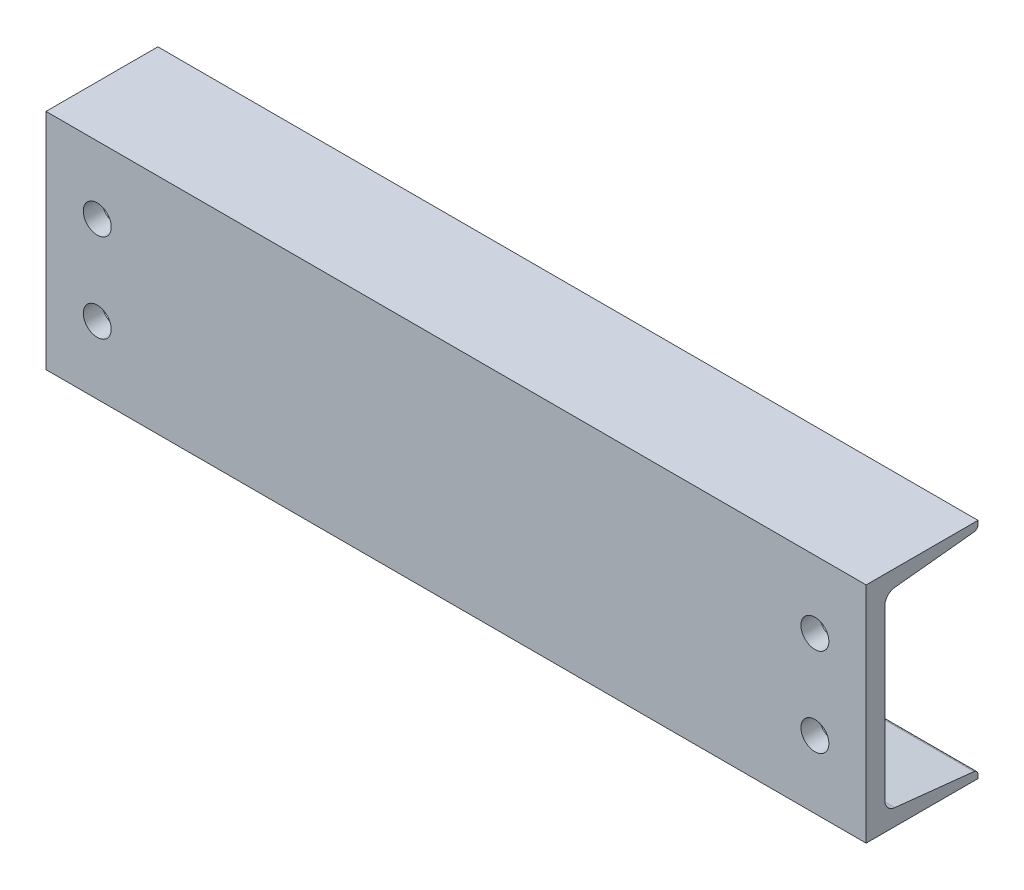
ISO-10303-21;
HEADER;
FILE_DESCRIPTION(('STEP AP214'),'2;1');
FILE_NAME('part.step','',(''),(''),'','','');
FILE_SCHEMA(('AUTOMOTIVE_DESIGN { 1 0 10303 214 1 1 1 1 }'));
ENDSEC;
DATA;
#1=APPLICATION_CONTEXT('core data for automotive mechanical design processes');
#2=APPLICATION_PROTOCOL_DEFINITION('international standard','automotive_design',2000,#1);
#3=PRODUCT_CONTEXT('',#1,'mechanical');
#4=PRODUCT('Part','Part','',(#3));
#5=PRODUCT_RELATED_PRODUCT_CATEGORY('part','',(#4));
#6=PRODUCT_DEFINITION_FORMATION('','',#4);
#7=PRODUCT_DEFINITION_CONTEXT('part definition',#1,'design');
#8=PRODUCT_DEFINITION('design','',#6,#7);
#9=PRODUCT_DEFINITION_SHAPE('','',#8);
#10=(LENGTH_UNIT() NAMED_UNIT(*) SI_UNIT(.MILLI.,.METRE.));
#11=(NAMED_UNIT(*) PLANE_ANGLE_UNIT() SI_UNIT($,.RADIAN.));
#12=(NAMED_UNIT(*) SI_UNIT($,.STERADIAN.) SOLID_ANGLE_UNIT());
#13=UNCERTAINTY_MEASURE_WITH_UNIT(LENGTH_MEASURE(1.E-05),#10,'distance_accuracy_value','');
#14=(GEOMETRIC_REPRESENTATION_CONTEXT(3) GLOBAL_UNCERTAINTY_ASSIGNED_CONTEXT((#13)) GLOBAL_UNIT_ASSIGNED_CONTEXT((#10,
#11,#12)) REPRESENTATION_CONTEXT('',''));
#15=CARTESIAN_POINT('',(0.,0.,0.));
#16=DIRECTION('',(0.,0.,1.));
#17=DIRECTION('',(1.,0.,0.));
#18=AXIS2_PLACEMENT_3D('',#15,#16,#17);
#19=CARTESIAN_POINT('',(279.4,-76.2,48.8061));
#20=DIRECTION('',(0.,1.,0.));
#21=DIRECTION('',(0.,0.,1.));
#22=AXIS2_PLACEMENT_3D('',#19,#20,#21);
#23=PLANE('',#22);
#24=CARTESIAN_POINT('',(165.1,-76.2,10.7061000000001));
#25=DIRECTION('',(0.,-1.,0.));
#26=DIRECTION('',(0.,0.,1.));
#27=AXIS2_PLACEMENT_3D('',#24,#25,#26);
#28=CIRCLE('',#27,9.525);
#29=CARTESIAN_POINT('',(165.1,-76.2,20.2311));
#30=VERTEX_POINT('',#29);
#31=EDGE_CURVE('E267',#30,#30,#28,.T.);
#32=ORIENTED_EDGE('',*,*,#31,.F.);
#33=EDGE_LOOP('',(#32));
#34=FACE_BOUND('',#33,.T.);
#35=CARTESIAN_POINT('',(-165.1,-76.2,10.7061));
#36=DIRECTION('',(0.,-1.,0.));
#37=DIRECTION('',(0.,0.,-1.));
#38=AXIS2_PLACEMENT_3D('',#35,#36,#37);
#39=CIRCLE('',#38,9.525);
#40=CARTESIAN_POINT('',(-165.1,-76.2,1.18110000000001));
#41=VERTEX_POINT('',#40);
#42=EDGE_CURVE('E270',#41,#41,#39,.T.);
#43=ORIENTED_EDGE('',*,*,#42,.F.);
#44=EDGE_LOOP('',(#43));
#45=FACE_BOUND('',#44,.T.);
#46=DIRECTION('',(0.,0.,-1.));
#47=VECTOR('',#46,1.);
#48=CARTESIAN_POINT('',(-279.4,-76.2,48.8061));
#49=LINE('',#48,#47);
#50=CARTESIAN_POINT('',(-279.4,-76.2,48.8061));
#51=VERTEX_POINT('',#50);
#52=CARTESIAN_POINT('',(-279.4,-76.2,-27.3939));
#53=VERTEX_POINT('',#52);
#54=EDGE_CURVE('E155',#51,#53,#49,.T.);
#55=ORIENTED_EDGE('',*,*,#54,.T.);
#56=DIRECTION('',(-1.,0.,0.));
#57=VECTOR('',#56,1.);
#58=CARTESIAN_POINT('',(279.4,-76.2,-27.3939));
#59=LINE('',#58,#57);
#60=CARTESIAN_POINT('',(279.4,-76.2,-27.3939));
#61=VERTEX_POINT('',#60);
#62=EDGE_CURVE('E11',#61,#53,#59,.T.);
#63=ORIENTED_EDGE('',*,*,#62,.F.);
#64=DIRECTION('',(0.,0.,-1.));
#65=VECTOR('',#64,1.);
#66=CARTESIAN_POINT('',(279.4,-76.2,48.8061));
#67=LINE('',#66,#65);
#68=CARTESIAN_POINT('',(279.4,-76.2,48.8061));
#69=VERTEX_POINT('',#68);
#70=EDGE_CURVE('E178',#69,#61,#67,.T.);
#71=ORIENTED_EDGE('',*,*,#70,.F.);
#72=DIRECTION('',(-1.,0.,0.));
#73=VECTOR('',#72,1.);
#74=CARTESIAN_POINT('',(279.4,-76.2,48.8061));
#75=LINE('',#74,#73);
#76=EDGE_CURVE('E151',#69,#51,#75,.T.);
#77=ORIENTED_EDGE('',*,*,#76,.T.);
#78=EDGE_LOOP('',(#55,#63,#71,#77));
#79=FACE_BOUND('',#78,.T.);
#80=ADVANCED_FACE('F35',(#34,#45,#79),#23,.F.);
#81=CARTESIAN_POINT('',(279.4,-76.2,-27.3939));
#82=DIRECTION('',(0.,0.,1.));
#83=DIRECTION('',(1.,0.,0.));
#84=AXIS2_PLACEMENT_3D('',#81,#82,#83);
#85=PLANE('',#84);
#86=DIRECTION('',(0.,1.,0.));
#87=VECTOR('',#86,1.);
#88=CARTESIAN_POINT('',(-279.4,-76.2,-27.3939));
#89=LINE('',#88,#87);
#90=CARTESIAN_POINT('',(-279.4,-73.7107446530364,-27.3939));
#91=VERTEX_POINT('',#90);
#92=EDGE_CURVE('E158',#53,#91,#89,.T.);
#93=ORIENTED_EDGE('',*,*,#92,.T.);
#94=DIRECTION('',(-1.,0.,0.));
#95=VECTOR('',#94,1.);
#96=CARTESIAN_POINT('',(279.4,-73.7107446530364,-27.3939));
#97=LINE('',#96,#95);
#98=CARTESIAN_POINT('',(279.4,-73.7107446530364,-27.3939));
#99=VERTEX_POINT('',#98);
#100=EDGE_CURVE('E43',#99,#91,#97,.T.);
#101=ORIENTED_EDGE('',*,*,#100,.F.);
#102=DIRECTION('',(0.,1.,0.));
#103=VECTOR('',#102,1.);
#104=CARTESIAN_POINT('',(279.4,-76.2,-27.3939));
#105=LINE('',#104,#103);
#106=EDGE_CURVE('E106',#61,#99,#105,.T.);
#107=ORIENTED_EDGE('',*,*,#106,.F.);
#108=ORIENTED_EDGE('',*,*,#62,.T.);
#109=EDGE_LOOP('',(#93,#101,#107,#108));
#110=FACE_BOUND('',#109,.T.);
#111=ADVANCED_FACE('F259',(#110),#85,.F.);
#112=CARTESIAN_POINT('',(279.4,-73.7107446530364,-24.3459));
#113=DIRECTION('',(-1.,0.,0.));
#114=DIRECTION('',(0.,0.,1.));
#115=AXIS2_PLACEMENT_3D('',#112,#113,#114);
#116=CYLINDRICAL_SURFACE('',#115,3.04799999999999);
#117=CARTESIAN_POINT('',(-279.4,-73.7107446530364,-24.3459));
#118=DIRECTION('',(1.,0.,0.));
#119=DIRECTION('',(0.,0.,-1.));
#120=AXIS2_PLACEMENT_3D('',#117,#118,#119);
#121=CIRCLE('',#120,3.04799999999999);
#122=CARTESIAN_POINT('',(-279.4,-70.6796721065635,-24.6666853145304));
#123=VERTEX_POINT('',#122);
#124=EDGE_CURVE('E161',#91,#123,#121,.T.);
#125=ORIENTED_EDGE('',*,*,#124,.T.);
#126=DIRECTION('',(-1.,0.,0.));
#127=VECTOR('',#126,1.);
#128=CARTESIAN_POINT('',(279.4,-70.6796721065635,-24.6666853145304));
#129=LINE('',#128,#127);
#130=CARTESIAN_POINT('',(279.4,-70.6796721065635,-24.6666853145304));
#131=VERTEX_POINT('',#130);
#132=EDGE_CURVE('E197',#131,#123,#129,.T.);
#133=ORIENTED_EDGE('',*,*,#132,.F.);
#134=CARTESIAN_POINT('',(279.4,-73.7107446530364,-24.3459));
#135=DIRECTION('',(1.,0.,0.));
#136=DIRECTION('',(0.,0.,-1.));
#137=AXIS2_PLACEMENT_3D('',#134,#135,#136);
#138=CIRCLE('',#137,3.04799999999999);
#139=EDGE_CURVE('E205',#99,#131,#138,.T.);
#140=ORIENTED_EDGE('',*,*,#139,.F.);
#141=ORIENTED_EDGE('',*,*,#100,.T.);
#142=EDGE_LOOP('',(#125,#133,#140,#141));
#143=FACE_BOUND('',#142,.T.);
#144=ADVANCED_FACE('F203',(#143),#116,.T.);
#145=CARTESIAN_POINT('',(279.4,-64.9695181148763,29.288063286326));
#146=DIRECTION('',(0.,-0.994446373514726,0.105244525764574));
#147=DIRECTION('',(0.,-0.105244525764574,-0.994446373514726));
#148=AXIS2_PLACEMENT_3D('',#145,#146,#147);
#149=PLANE('',#148);
#150=CARTESIAN_POINT('',(165.1,-66.9360896323852,10.7061000000001));
#151=DIRECTION('',(0.,-0.994446373514726,0.105244525764574));
#152=DIRECTION('',(0.,-0.105244525764574,-0.994446373514726));
#153=AXIS2_PLACEMENT_3D('',#150,#151,#152);
#154=ELLIPSE('',#153,9.57819371027044,9.525);
#155=CARTESIAN_POINT('',(165.1,-67.9441420871039,1.18110000000005));
#156=VERTEX_POINT('',#155);
#157=EDGE_CURVE('E273',#156,#156,#154,.F.);
#158=ORIENTED_EDGE('',*,*,#157,.F.);
#159=EDGE_LOOP('',(#158));
#160=FACE_BOUND('',#159,.T.);
#161=CARTESIAN_POINT('',(-165.1,-66.9360896323853,10.7061));
#162=DIRECTION('',(0.,-0.994446373514726,0.105244525764574));
#163=DIRECTION('',(0.,-0.105244525764574,-0.994446373514726));
#164=AXIS2_PLACEMENT_3D('',#161,#162,#163);
#165=ELLIPSE('',#164,9.57819371027044,9.525);
#166=CARTESIAN_POINT('',(-165.1,-67.9441420871039,1.18110000000001));
#167=VERTEX_POINT('',#166);
#168=EDGE_CURVE('E272',#167,#167,#165,.F.);
#169=ORIENTED_EDGE('',*,*,#168,.F.);
#170=EDGE_LOOP('',(#169));
#171=FACE_BOUND('',#170,.T.);
#172=DIRECTION('',(0.,0.105244525764574,0.994446373514726));
#173=VECTOR('',#172,1.);
#174=CARTESIAN_POINT('',(-279.4,-64.9695181148763,29.288063286326));
#175=LINE('',#174,#173);
#176=CARTESIAN_POINT('',(-279.4,-64.9695181148763,29.288063286326));
#177=VERTEX_POINT('',#176);
#178=EDGE_CURVE('E163',#123,#177,#175,.T.);
#179=ORIENTED_EDGE('',*,*,#178,.T.);
#180=DIRECTION('',(-1.,0.,0.));
#181=VECTOR('',#180,1.);
#182=CARTESIAN_POINT('',(279.4,-64.9695181148763,29.288063286326));
#183=LINE('',#182,#181);
#184=CARTESIAN_POINT('',(279.4,-64.9695181148763,29.288063286326));
#185=VERTEX_POINT('',#184);
#186=EDGE_CURVE('E194',#185,#177,#183,.T.);
#187=ORIENTED_EDGE('',*,*,#186,.F.);
#188=DIRECTION('',(0.,0.105244525764574,0.994446373514726));
#189=VECTOR('',#188,1.);
#190=CARTESIAN_POINT('',(279.4,-64.9695181148763,29.288063286326));
#191=LINE('',#190,#189);
#192=EDGE_CURVE('E223',#131,#185,#191,.T.);
#193=ORIENTED_EDGE('',*,*,#192,.F.);
#194=ORIENTED_EDGE('',*,*,#132,.T.);
#195=EDGE_LOOP('',(#179,#187,#193,#194));
#196=FACE_BOUND('',#195,.T.);
#197=ADVANCED_FACE('F214',(#160,#171,#196),#149,.F.);
#198=CARTESIAN_POINT('',(279.4,-57.3918367486941,28.4861));
#199=DIRECTION('',(-1.,0.,0.));
#200=DIRECTION('',(0.,0.,1.));
#201=AXIS2_PLACEMENT_3D('',#198,#199,#200);
#202=CYLINDRICAL_SURFACE('',#201,7.62000000000001);
#203=CARTESIAN_POINT('',(-279.4,-57.3918367486941,28.4861));
#204=DIRECTION('',(-1.,0.,0.));
#205=DIRECTION('',(0.,0.,-1.));
#206=AXIS2_PLACEMENT_3D('',#203,#204,#205);
#207=CIRCLE('',#206,7.62000000000001);
#208=CARTESIAN_POINT('',(-279.4,-57.3918367486941,36.1061));
#209=VERTEX_POINT('',#208);
#210=EDGE_CURVE('E165',#177,#209,#207,.T.);
#211=ORIENTED_EDGE('',*,*,#210,.T.);
#212=DIRECTION('',(-1.,0.,0.));
#213=VECTOR('',#212,1.);
#214=CARTESIAN_POINT('',(279.4,-57.3918367486941,36.1061));
#215=LINE('',#214,#213);
#216=CARTESIAN_POINT('',(279.4,-57.3918367486941,36.1061));
#217=VERTEX_POINT('',#216);
#218=EDGE_CURVE('E191',#217,#209,#215,.T.);
#219=ORIENTED_EDGE('',*,*,#218,.F.);
#220=CARTESIAN_POINT('',(279.4,-57.3918367486941,28.4861));
#221=DIRECTION('',(-1.,0.,0.));
#222=DIRECTION('',(0.,0.,-1.));
#223=AXIS2_PLACEMENT_3D('',#220,#221,#222);
#224=CIRCLE('',#223,7.62000000000001);
#225=EDGE_CURVE('E220',#185,#217,#224,.T.);
#226=ORIENTED_EDGE('',*,*,#225,.F.);
#227=ORIENTED_EDGE('',*,*,#186,.T.);
#228=EDGE_LOOP('',(#211,#219,#226,#227));
#229=FACE_BOUND('',#228,.T.);
#230=ADVANCED_FACE('F218',(#229),#202,.F.);
#231=CARTESIAN_POINT('',(279.4,57.3918367486941,36.1061));
#232=DIRECTION('',(0.,0.,1.));
#233=DIRECTION('',(0.,-1.,0.));
#234=AXIS2_PLACEMENT_3D('',#231,#232,#233);
#235=PLANE('',#234);
#236=CARTESIAN_POINT('',(244.475,30.1625,36.1061));
#237=DIRECTION('',(0.,0.,1.));
#238=DIRECTION('',(0.,-1.,0.));
#239=AXIS2_PLACEMENT_3D('',#236,#237,#238);
#240=CIRCLE('',#239,9.52500000000002);
#241=CARTESIAN_POINT('',(244.475,20.6374999999999,36.1061));
#242=VERTEX_POINT('',#241);
#243=EDGE_CURVE('E284',#242,#242,#240,.F.);
#244=ORIENTED_EDGE('',*,*,#243,.F.);
#245=EDGE_LOOP('',(#244));
#246=FACE_BOUND('',#245,.T.);
#247=CARTESIAN_POINT('',(244.475,-30.1625,36.1061));
#248=DIRECTION('',(0.,0.,1.));
#249=DIRECTION('',(0.,-1.,0.));
#250=AXIS2_PLACEMENT_3D('',#247,#248,#249);
#251=CIRCLE('',#250,9.52500000000002);
#252=CARTESIAN_POINT('',(244.475,-39.6875,36.1061));
#253=VERTEX_POINT('',#252);
#254=EDGE_CURVE('E290',#253,#253,#251,.F.);
#255=ORIENTED_EDGE('',*,*,#254,.F.);
#256=EDGE_LOOP('',(#255));
#257=FACE_BOUND('',#256,.T.);
#258=CARTESIAN_POINT('',(-244.475,-30.1625,36.1061));
#259=DIRECTION('',(0.,0.,1.));
#260=DIRECTION('',(0.,-1.,0.));
#261=AXIS2_PLACEMENT_3D('',#258,#259,#260);
#262=CIRCLE('',#261,9.52500000000002);
#263=CARTESIAN_POINT('',(-244.475,-39.6875000000001,36.1061));
#264=VERTEX_POINT('',#263);
#265=EDGE_CURVE('E296',#264,#264,#262,.F.);
#266=ORIENTED_EDGE('',*,*,#265,.F.);
#267=EDGE_LOOP('',(#266));
#268=FACE_BOUND('',#267,.T.);
#269=CARTESIAN_POINT('',(-244.475,30.1625,36.1061));
#270=DIRECTION('',(0.,0.,1.));
#271=DIRECTION('',(0.,-1.,0.));
#272=AXIS2_PLACEMENT_3D('',#269,#270,#271);
#273=CIRCLE('',#272,9.52500000000002);
#274=CARTESIAN_POINT('',(-244.475,20.6375,36.1061));
#275=VERTEX_POINT('',#274);
#276=EDGE_CURVE('E159',#275,#275,#273,.F.);
#277=ORIENTED_EDGE('',*,*,#276,.F.);
#278=EDGE_LOOP('',(#277));
#279=FACE_BOUND('',#278,.T.);
#280=DIRECTION('',(0.,1.,0.));
#281=VECTOR('',#280,1.);
#282=CARTESIAN_POINT('',(-279.4,57.3918367486941,36.1061));
#283=LINE('',#282,#281);
#284=CARTESIAN_POINT('',(-279.4,57.3918367486941,36.1061));
#285=VERTEX_POINT('',#284);
#286=EDGE_CURVE('E167',#209,#285,#283,.T.);
#287=ORIENTED_EDGE('',*,*,#286,.T.);
#288=DIRECTION('',(-1.,0.,0.));
#289=VECTOR('',#288,1.);
#290=CARTESIAN_POINT('',(279.4,57.3918367486941,36.1061));
#291=LINE('',#290,#289);
#292=CARTESIAN_POINT('',(279.4,57.3918367486941,36.1061));
#293=VERTEX_POINT('',#292);
#294=EDGE_CURVE('E188',#293,#285,#291,.T.);
#295=ORIENTED_EDGE('',*,*,#294,.F.);
#296=DIRECTION('',(0.,1.,0.));
#297=VECTOR('',#296,1.);
#298=CARTESIAN_POINT('',(279.4,57.3918367486941,36.1061));
#299=LINE('',#298,#297);
#300=EDGE_CURVE('E222',#217,#293,#299,.T.);
#301=ORIENTED_EDGE('',*,*,#300,.F.);
#302=ORIENTED_EDGE('',*,*,#218,.T.);
#303=EDGE_LOOP('',(#287,#295,#301,#302));
#304=FACE_BOUND('',#303,.T.);
#305=ADVANCED_FACE('F309',(#246,#257,#268,#279,#304),#235,.F.);
#306=CARTESIAN_POINT('',(279.4,57.3918367486941,28.4861));
#307=DIRECTION('',(-1.,0.,0.));
#308=DIRECTION('',(0.,0.,1.));
#309=AXIS2_PLACEMENT_3D('',#306,#307,#308);
#310=CYLINDRICAL_SURFACE('',#309,7.62000000000002);
#311=CARTESIAN_POINT('',(-279.4,57.3918367486941,28.4861));
#312=DIRECTION('',(-1.,0.,0.));
#313=DIRECTION('',(0.,0.,1.));
#314=AXIS2_PLACEMENT_3D('',#311,#312,#313);
#315=CIRCLE('',#314,7.62000000000002);
#316=CARTESIAN_POINT('',(-279.4,64.9695181148764,29.2880632863261));
#317=VERTEX_POINT('',#316);
#318=EDGE_CURVE('E169',#285,#317,#315,.T.);
#319=ORIENTED_EDGE('',*,*,#318,.T.);
#320=DIRECTION('',(-1.,0.,0.));
#321=VECTOR('',#320,1.);
#322=CARTESIAN_POINT('',(279.4,64.9695181148764,29.2880632863261));
#323=LINE('',#322,#321);
#324=CARTESIAN_POINT('',(279.4,64.9695181148764,29.2880632863261));
#325=VERTEX_POINT('',#324);
#326=EDGE_CURVE('E185',#325,#317,#323,.T.);
#327=ORIENTED_EDGE('',*,*,#326,.F.);
#328=CARTESIAN_POINT('',(279.4,57.3918367486941,28.4861));
#329=DIRECTION('',(-1.,0.,0.));
#330=DIRECTION('',(0.,0.,1.));
#331=AXIS2_PLACEMENT_3D('',#328,#329,#330);
#332=CIRCLE('',#331,7.62000000000002);
#333=EDGE_CURVE('E225',#293,#325,#332,.T.);
#334=ORIENTED_EDGE('',*,*,#333,.F.);
#335=ORIENTED_EDGE('',*,*,#294,.T.);
#336=EDGE_LOOP('',(#319,#327,#334,#335));
#337=FACE_BOUND('',#336,.T.);
#338=ADVANCED_FACE('F312',(#337),#310,.F.);
#339=CARTESIAN_POINT('',(279.4,64.9695181148764,29.2880632863261));
#340=DIRECTION('',(0.,0.994446373514726,0.105244525764573));
#341=DIRECTION('',(0.,-0.105244525764573,0.994446373514726));
#342=AXIS2_PLACEMENT_3D('',#339,#340,#341);
#343=PLANE('',#342);
#344=DIRECTION('',(0.,0.105244525764573,-0.994446373514726));
#345=VECTOR('',#344,1.);
#346=CARTESIAN_POINT('',(-279.4,64.9695181148764,29.2880632863261));
#347=LINE('',#346,#345);
#348=CARTESIAN_POINT('',(-279.4,70.6796721065635,-24.6666853145304));
#349=VERTEX_POINT('',#348);
#350=EDGE_CURVE('E171',#317,#349,#347,.T.);
#351=ORIENTED_EDGE('',*,*,#350,.T.);
#352=DIRECTION('',(-1.,0.,0.));
#353=VECTOR('',#352,1.);
#354=CARTESIAN_POINT('',(279.4,70.6796721065635,-24.6666853145304));
#355=LINE('',#354,#353);
#356=CARTESIAN_POINT('',(279.4,70.6796721065635,-24.6666853145304));
#357=VERTEX_POINT('',#356);
#358=EDGE_CURVE('E182',#357,#349,#355,.T.);
#359=ORIENTED_EDGE('',*,*,#358,.F.);
#360=DIRECTION('',(0.,0.105244525764573,-0.994446373514726));
#361=VECTOR('',#360,1.);
#362=CARTESIAN_POINT('',(279.4,64.9695181148764,29.2880632863261));
#363=LINE('',#362,#361);
#364=EDGE_CURVE('E231',#325,#357,#363,.T.);
#365=ORIENTED_EDGE('',*,*,#364,.F.);
#366=ORIENTED_EDGE('',*,*,#326,.T.);
#367=EDGE_LOOP('',(#351,#359,#365,#366));
#368=FACE_BOUND('',#367,.T.);
#369=ADVANCED_FACE('F237',(#368),#343,.F.);
#370=CARTESIAN_POINT('',(279.4,73.7107446530364,-24.3459));
#371=DIRECTION('',(-1.,0.,0.));
#372=DIRECTION('',(0.,0.,1.));
#373=AXIS2_PLACEMENT_3D('',#370,#371,#372);
#374=CYLINDRICAL_SURFACE('',#373,3.048);
#375=CARTESIAN_POINT('',(-279.4,73.7107446530364,-24.3459));
#376=DIRECTION('',(1.,0.,0.));
#377=DIRECTION('',(0.,0.,1.));
#378=AXIS2_PLACEMENT_3D('',#375,#376,#377);
#379=CIRCLE('',#378,3.048);
#380=CARTESIAN_POINT('',(-279.4,73.7107446530364,-27.3939));
#381=VERTEX_POINT('',#380);
#382=EDGE_CURVE('E173',#349,#381,#379,.T.);
#383=ORIENTED_EDGE('',*,*,#382,.T.);
#384=DIRECTION('',(-1.,0.,0.));
#385=VECTOR('',#384,1.);
#386=CARTESIAN_POINT('',(279.4,73.7107446530364,-27.3939));
#387=LINE('',#386,#385);
#388=CARTESIAN_POINT('',(279.4,73.7107446530364,-27.3939));
#389=VERTEX_POINT('',#388);
#390=EDGE_CURVE('E146',#389,#381,#387,.T.);
#391=ORIENTED_EDGE('',*,*,#390,.F.);
#392=CARTESIAN_POINT('',(279.4,73.7107446530364,-24.3459));
#393=DIRECTION('',(1.,0.,0.));
#394=DIRECTION('',(0.,0.,1.));
#395=AXIS2_PLACEMENT_3D('',#392,#393,#394);
#396=CIRCLE('',#395,3.048);
#397=EDGE_CURVE('E137',#357,#389,#396,.T.);
#398=ORIENTED_EDGE('',*,*,#397,.F.);
#399=ORIENTED_EDGE('',*,*,#358,.T.);
#400=EDGE_LOOP('',(#383,#391,#398,#399));
#401=FACE_BOUND('',#400,.T.);
#402=ADVANCED_FACE('F241',(#401),#374,.T.);
#403=CARTESIAN_POINT('',(279.4,76.2,-27.3939));
#404=DIRECTION('',(0.,0.,1.));
#405=DIRECTION('',(0.,-1.,0.));
#406=AXIS2_PLACEMENT_3D('',#403,#404,#405);
#407=PLANE('',#406);
#408=DIRECTION('',(0.,1.,0.));
#409=VECTOR('',#408,1.);
#410=CARTESIAN_POINT('',(-279.4,76.2,-27.3939));
#411=LINE('',#410,#409);
#412=CARTESIAN_POINT('',(-279.4,76.2,-27.3939));
#413=VERTEX_POINT('',#412);
#414=EDGE_CURVE('E145',#381,#413,#411,.T.);
#415=ORIENTED_EDGE('',*,*,#414,.T.);
#416=DIRECTION('',(-1.,0.,0.));
#417=VECTOR('',#416,1.);
#418=CARTESIAN_POINT('',(279.4,76.2,-27.3939));
#419=LINE('',#418,#417);
#420=CARTESIAN_POINT('',(279.4,76.2,-27.3939));
#421=VERTEX_POINT('',#420);
#422=EDGE_CURVE('E142',#421,#413,#419,.T.);
#423=ORIENTED_EDGE('',*,*,#422,.F.);
#424=DIRECTION('',(0.,1.,0.));
#425=VECTOR('',#424,1.);
#426=CARTESIAN_POINT('',(279.4,76.2,-27.3939));
#427=LINE('',#426,#425);
#428=EDGE_CURVE('E131',#389,#421,#427,.T.);
#429=ORIENTED_EDGE('',*,*,#428,.F.);
#430=ORIENTED_EDGE('',*,*,#390,.T.);
#431=EDGE_LOOP('',(#415,#423,#429,#430));
#432=FACE_BOUND('',#431,.T.);
#433=ADVANCED_FACE('F143',(#432),#407,.F.);
#434=CARTESIAN_POINT('',(279.4,76.2,48.8061));
#435=DIRECTION('',(0.,-1.,0.));
#436=DIRECTION('',(0.,0.,-1.));
#437=AXIS2_PLACEMENT_3D('',#434,#435,#436);
#438=PLANE('',#437);
#439=DIRECTION('',(0.,0.,1.));
#440=VECTOR('',#439,1.);
#441=CARTESIAN_POINT('',(-279.4,76.2,48.8061));
#442=LINE('',#441,#440);
#443=CARTESIAN_POINT('',(-279.4,76.2,48.8061));
#444=VERTEX_POINT('',#443);
#445=EDGE_CURVE('E92',#413,#444,#442,.T.);
#446=ORIENTED_EDGE('',*,*,#445,.T.);
#447=DIRECTION('',(-1.,0.,0.));
#448=VECTOR('',#447,1.);
#449=CARTESIAN_POINT('',(279.4,76.2,48.8061));
#450=LINE('',#449,#448);
#451=CARTESIAN_POINT('',(279.4,76.2,48.8061));
#452=VERTEX_POINT('',#451);
#453=EDGE_CURVE('E147',#452,#444,#450,.T.);
#454=ORIENTED_EDGE('',*,*,#453,.F.);
#455=DIRECTION('',(0.,0.,1.));
#456=VECTOR('',#455,1.);
#457=CARTESIAN_POINT('',(279.4,76.2,48.8061));
#458=LINE('',#457,#456);
#459=EDGE_CURVE('E135',#421,#452,#458,.T.);
#460=ORIENTED_EDGE('',*,*,#459,.F.);
#461=ORIENTED_EDGE('',*,*,#422,.T.);
#462=EDGE_LOOP('',(#446,#454,#460,#461));
#463=FACE_BOUND('',#462,.T.);
#464=ADVANCED_FACE('F149',(#463),#438,.F.);
#465=CARTESIAN_POINT('',(279.4,-76.2,48.8061));
#466=DIRECTION('',(0.,0.,-1.));
#467=DIRECTION('',(-1.,0.,0.));
#468=AXIS2_PLACEMENT_3D('',#465,#466,#467);
#469=PLANE('',#468);
#470=CARTESIAN_POINT('',(244.475,30.1625,48.8061));
#471=DIRECTION('',(0.,0.,1.));
#472=DIRECTION('',(-1.,0.,0.));
#473=AXIS2_PLACEMENT_3D('',#470,#471,#472);
#474=CIRCLE('',#473,9.52500000000002);
#475=CARTESIAN_POINT('',(234.95,30.1625,48.8061));
#476=VERTEX_POINT('',#475);
#477=EDGE_CURVE('E276',#476,#476,#474,.T.);
#478=ORIENTED_EDGE('',*,*,#477,.F.);
#479=EDGE_LOOP('',(#478));
#480=FACE_BOUND('',#479,.T.);
#481=CARTESIAN_POINT('',(244.475,-30.1625,48.8061));
#482=DIRECTION('',(0.,0.,1.));
#483=DIRECTION('',(1.,0.,0.));
#484=AXIS2_PLACEMENT_3D('',#481,#482,#483);
#485=CIRCLE('',#484,9.52500000000002);
#486=CARTESIAN_POINT('',(254.,-30.1625,48.8061));
#487=VERTEX_POINT('',#486);
#488=EDGE_CURVE('E287',#487,#487,#485,.T.);
#489=ORIENTED_EDGE('',*,*,#488,.F.);
#490=EDGE_LOOP('',(#489));
#491=FACE_BOUND('',#490,.T.);
#492=CARTESIAN_POINT('',(-244.475,-30.1625,48.8061));
#493=DIRECTION('',(0.,0.,1.));
#494=DIRECTION('',(-1.,0.,0.));
#495=AXIS2_PLACEMENT_3D('',#492,#493,#494);
#496=CIRCLE('',#495,9.52500000000002);
#497=CARTESIAN_POINT('',(-254.,-30.1625,48.8061));
#498=VERTEX_POINT('',#497);
#499=EDGE_CURVE('E293',#498,#498,#496,.T.);
#500=ORIENTED_EDGE('',*,*,#499,.F.);
#501=EDGE_LOOP('',(#500));
#502=FACE_BOUND('',#501,.T.);
#503=CARTESIAN_POINT('',(-244.475,30.1625,48.8061));
#504=DIRECTION('',(0.,0.,1.));
#505=DIRECTION('',(1.,0.,0.));
#506=AXIS2_PLACEMENT_3D('',#503,#504,#505);
#507=CIRCLE('',#506,9.52500000000002);
#508=CARTESIAN_POINT('',(-234.95,30.1625,48.8061));
#509=VERTEX_POINT('',#508);
#510=EDGE_CURVE('E299',#509,#509,#507,.T.);
#511=ORIENTED_EDGE('',*,*,#510,.F.);
#512=EDGE_LOOP('',(#511));
#513=FACE_BOUND('',#512,.T.);
#514=DIRECTION('',(0.,-1.,0.));
#515=VECTOR('',#514,1.);
#516=CARTESIAN_POINT('',(-279.4,-76.2,48.8061));
#517=LINE('',#516,#515);
#518=EDGE_CURVE('E98',#444,#51,#517,.T.);
#519=ORIENTED_EDGE('',*,*,#518,.T.);
#520=ORIENTED_EDGE('',*,*,#76,.F.);
#521=DIRECTION('',(0.,-1.,0.));
#522=VECTOR('',#521,1.);
#523=CARTESIAN_POINT('',(279.4,-76.2,48.8061));
#524=LINE('',#523,#522);
#525=EDGE_CURVE('E51',#452,#69,#524,.T.);
#526=ORIENTED_EDGE('',*,*,#525,.F.);
#527=ORIENTED_EDGE('',*,*,#453,.T.);
#528=EDGE_LOOP('',(#519,#520,#526,#527));
#529=FACE_BOUND('',#528,.T.);
#530=ADVANCED_FACE('F245',(#480,#491,#502,#513,#529),#469,.F.);
#531=CARTESIAN_POINT('',(279.4,-73.7107446530364,-24.3459));
#532=DIRECTION('',(1.,0.,0.));
#533=DIRECTION('',(0.,0.,-1.));
#534=AXIS2_PLACEMENT_3D('',#531,#532,#533);
#535=PLANE('',#534);
#536=ORIENTED_EDGE('',*,*,#70,.T.);
#537=ORIENTED_EDGE('',*,*,#106,.T.);
#538=ORIENTED_EDGE('',*,*,#139,.T.);
#539=ORIENTED_EDGE('',*,*,#192,.T.);
#540=ORIENTED_EDGE('',*,*,#225,.T.);
#541=ORIENTED_EDGE('',*,*,#300,.T.);
#542=ORIENTED_EDGE('',*,*,#333,.T.);
#543=ORIENTED_EDGE('',*,*,#364,.T.);
#544=ORIENTED_EDGE('',*,*,#397,.T.);
#545=ORIENTED_EDGE('',*,*,#428,.T.);
#546=ORIENTED_EDGE('',*,*,#459,.T.);
#547=ORIENTED_EDGE('',*,*,#525,.T.);
#548=EDGE_LOOP('',(#536,#537,#538,#539,#540,#541,#542,#543,#544,#545,#546,#547));
#549=FACE_BOUND('',#548,.T.);
#550=ADVANCED_FACE('F133',(#549),#535,.T.);
#551=CARTESIAN_POINT('',(-279.4,-73.7107446530364,-24.3459));
#552=DIRECTION('',(1.,0.,0.));
#553=DIRECTION('',(0.,0.,-1.));
#554=AXIS2_PLACEMENT_3D('',#551,#552,#553);
#555=PLANE('',#554);
#556=ORIENTED_EDGE('',*,*,#54,.F.);
#557=ORIENTED_EDGE('',*,*,#518,.F.);
#558=ORIENTED_EDGE('',*,*,#445,.F.);
#559=ORIENTED_EDGE('',*,*,#414,.F.);
#560=ORIENTED_EDGE('',*,*,#382,.F.);
#561=ORIENTED_EDGE('',*,*,#350,.F.);
#562=ORIENTED_EDGE('',*,*,#318,.F.);
#563=ORIENTED_EDGE('',*,*,#286,.F.);
#564=ORIENTED_EDGE('',*,*,#210,.F.);
#565=ORIENTED_EDGE('',*,*,#178,.F.);
#566=ORIENTED_EDGE('',*,*,#124,.F.);
#567=ORIENTED_EDGE('',*,*,#92,.F.);
#568=EDGE_LOOP('',(#556,#557,#558,#559,#560,#561,#562,#563,#564,#565,#566,#567));
#569=FACE_BOUND('',#568,.T.);
#570=ADVANCED_FACE('F209',(#569),#555,.F.);
#571=CARTESIAN_POINT('',(-244.475,30.1625,-27.3949));
#572=DIRECTION('',(0.,0.,1.));
#573=DIRECTION('',(1.,0.,0.));
#574=AXIS2_PLACEMENT_3D('',#571,#572,#573);
#575=CYLINDRICAL_SURFACE('',#574,9.52500000000002);
#576=ORIENTED_EDGE('',*,*,#510,.T.);
#577=EDGE_LOOP('',(#576));
#578=FACE_BOUND('',#577,.T.);
#579=ORIENTED_EDGE('',*,*,#276,.T.);
#580=EDGE_LOOP('',(#579));
#581=FACE_BOUND('',#580,.T.);
#582=ADVANCED_FACE('F307',(#578,#581),#575,.F.);
#583=CARTESIAN_POINT('',(-244.475,-30.1625,-27.3949));
#584=DIRECTION('',(0.,0.,1.));
#585=DIRECTION('',(1.,0.,0.));
#586=AXIS2_PLACEMENT_3D('',#583,#584,#585);
#587=CYLINDRICAL_SURFACE('',#586,9.52500000000002);
#588=ORIENTED_EDGE('',*,*,#499,.T.);
#589=EDGE_LOOP('',(#588));
#590=FACE_BOUND('',#589,.T.);
#591=ORIENTED_EDGE('',*,*,#265,.T.);
#592=EDGE_LOOP('',(#591));
#593=FACE_BOUND('',#592,.T.);
#594=ADVANCED_FACE('F370',(#590,#593),#587,.F.);
#595=CARTESIAN_POINT('',(244.475,-30.1625,-27.3949));
#596=DIRECTION('',(0.,0.,1.));
#597=DIRECTION('',(1.,0.,0.));
#598=AXIS2_PLACEMENT_3D('',#595,#596,#597);
#599=CYLINDRICAL_SURFACE('',#598,9.52500000000002);
#600=ORIENTED_EDGE('',*,*,#488,.T.);
#601=EDGE_LOOP('',(#600));
#602=FACE_BOUND('',#601,.T.);
#603=ORIENTED_EDGE('',*,*,#254,.T.);
#604=EDGE_LOOP('',(#603));
#605=FACE_BOUND('',#604,.T.);
#606=ADVANCED_FACE('F380',(#602,#605),#599,.F.);
#607=CARTESIAN_POINT('',(244.475,30.1625,-27.3949));
#608=DIRECTION('',(0.,0.,1.));
#609=DIRECTION('',(1.,0.,0.));
#610=AXIS2_PLACEMENT_3D('',#607,#608,#609);
#611=CYLINDRICAL_SURFACE('',#610,9.52500000000002);
#612=ORIENTED_EDGE('',*,*,#477,.T.);
#613=EDGE_LOOP('',(#612));
#614=FACE_BOUND('',#613,.T.);
#615=ORIENTED_EDGE('',*,*,#243,.T.);
#616=EDGE_LOOP('',(#615));
#617=FACE_BOUND('',#616,.T.);
#618=ADVANCED_FACE('F390',(#614,#617),#611,.F.);
#619=CARTESIAN_POINT('',(-165.1,76.201,10.7061));
#620=DIRECTION('',(0.,-1.,0.));
#621=DIRECTION('',(0.,0.,-1.));
#622=AXIS2_PLACEMENT_3D('',#619,#620,#621);
#623=CYLINDRICAL_SURFACE('',#622,9.525);
#624=ORIENTED_EDGE('',*,*,#42,.T.);
#625=EDGE_LOOP('',(#624));
#626=FACE_BOUND('',#625,.T.);
#627=ORIENTED_EDGE('',*,*,#168,.T.);
#628=EDGE_LOOP('',(#627));
#629=FACE_BOUND('',#628,.T.);
#630=ADVANCED_FACE('F399',(#626,#629),#623,.F.);
#631=CARTESIAN_POINT('',(165.1,76.201,10.7061000000001));
#632=DIRECTION('',(0.,-1.,0.));
#633=DIRECTION('',(0.,0.,-1.));
#634=AXIS2_PLACEMENT_3D('',#631,#632,#633);
#635=CYLINDRICAL_SURFACE('',#634,9.525);
#636=ORIENTED_EDGE('',*,*,#31,.T.);
#637=EDGE_LOOP('',(#636));
#638=FACE_BOUND('',#637,.T.);
#639=ORIENTED_EDGE('',*,*,#157,.T.);
#640=EDGE_LOOP('',(#639));
#641=FACE_BOUND('',#640,.T.);
#642=ADVANCED_FACE('F423',(#638,#641),#635,.F.);
#643=CLOSED_SHELL('',(#80,#111,#144,#197,#230,#305,#338,#369,#402,#433,#464,#530,#550,#570,#582,
#594,#606,#618,#630,#642));
#644=MANIFOLD_SOLID_BREP('B2',#643);
#645=ADVANCED_BREP_SHAPE_REPRESENTATION('',(#18,#644),#14);
#646=SHAPE_DEFINITION_REPRESENTATION(#9,#645);
ENDSEC;
END-ISO-10303-21;
